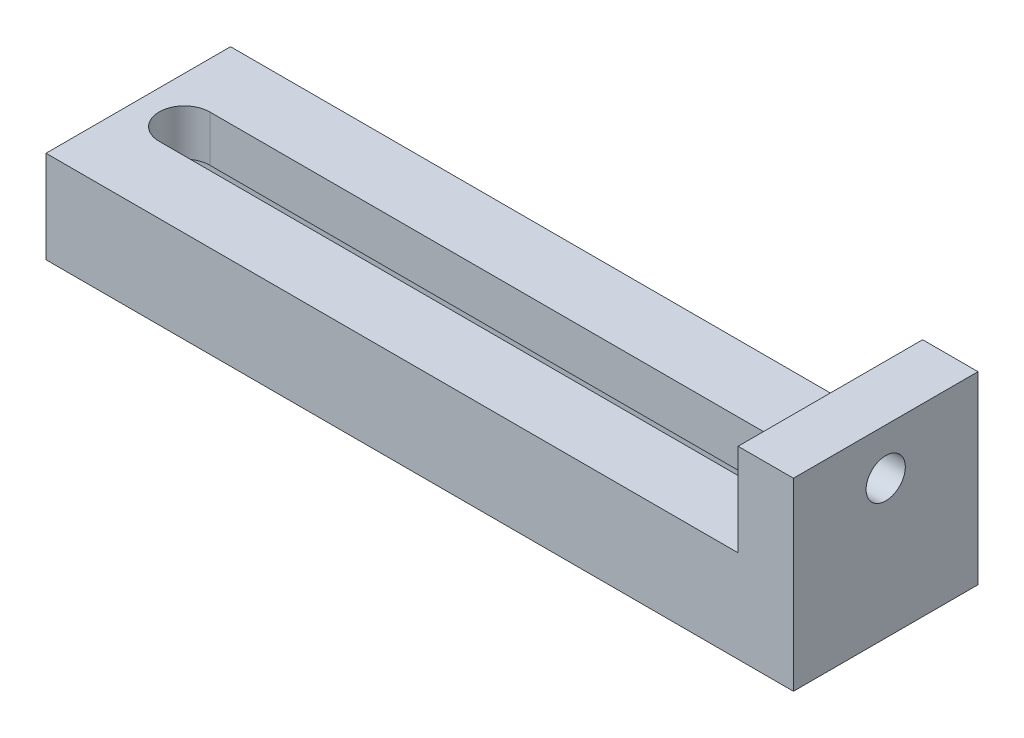
ISO-10303-21;
HEADER;
FILE_DESCRIPTION(('STEP AP214'),'2;1');
FILE_NAME('part.step','',(''),(''),'','','');
FILE_SCHEMA(('AUTOMOTIVE_DESIGN { 1 0 10303 214 1 1 1 1 }'));
ENDSEC;
DATA;
#1=APPLICATION_CONTEXT('core data for automotive mechanical design processes');
#2=APPLICATION_PROTOCOL_DEFINITION('international standard','automotive_design',2000,#1);
#3=PRODUCT_CONTEXT('',#1,'mechanical');
#4=PRODUCT('Part','Part','',(#3));
#5=PRODUCT_RELATED_PRODUCT_CATEGORY('part','',(#4));
#6=PRODUCT_DEFINITION_FORMATION('','',#4);
#7=PRODUCT_DEFINITION_CONTEXT('part definition',#1,'design');
#8=PRODUCT_DEFINITION('design','',#6,#7);
#9=PRODUCT_DEFINITION_SHAPE('','',#8);
#10=(LENGTH_UNIT() NAMED_UNIT(*) SI_UNIT(.MILLI.,.METRE.));
#11=(NAMED_UNIT(*) PLANE_ANGLE_UNIT() SI_UNIT($,.RADIAN.));
#12=(NAMED_UNIT(*) SI_UNIT($,.STERADIAN.) SOLID_ANGLE_UNIT());
#13=UNCERTAINTY_MEASURE_WITH_UNIT(LENGTH_MEASURE(1.E-05),#10,'distance_accuracy_value','');
#14=(GEOMETRIC_REPRESENTATION_CONTEXT(3) GLOBAL_UNCERTAINTY_ASSIGNED_CONTEXT((#13)) GLOBAL_UNIT_ASSIGNED_CONTEXT((#10,
#11,#12)) REPRESENTATION_CONTEXT('',''));
#15=CARTESIAN_POINT('',(0.,0.,0.));
#16=DIRECTION('',(0.,0.,1.));
#17=DIRECTION('',(1.,0.,0.));
#18=AXIS2_PLACEMENT_3D('',#15,#16,#17);
#19=CARTESIAN_POINT('',(-75.,20.,-20.));
#20=DIRECTION('',(0.,0.,1.));
#21=DIRECTION('',(1.,0.,0.));
#22=AXIS2_PLACEMENT_3D('',#19,#20,#21);
#23=PLANE('',#22);
#24=DIRECTION('',(-1.,0.,0.));
#25=VECTOR('',#24,1.);
#26=CARTESIAN_POINT('',(-75.,0.,-20.));
#27=LINE('',#26,#25);
#28=CARTESIAN_POINT('',(87.,0.,-20.));
#29=VERTEX_POINT('',#28);
#30=CARTESIAN_POINT('',(-75.,0.,-20.));
#31=VERTEX_POINT('',#30);
#32=EDGE_CURVE('E165',#29,#31,#27,.T.);
#33=ORIENTED_EDGE('',*,*,#32,.T.);
#34=DIRECTION('',(0.,-1.,0.));
#35=VECTOR('',#34,1.);
#36=CARTESIAN_POINT('',(-75.,20.,-20.));
#37=LINE('',#36,#35);
#38=CARTESIAN_POINT('',(-75.,20.,-20.));
#39=VERTEX_POINT('',#38);
#40=EDGE_CURVE('E45',#39,#31,#37,.T.);
#41=ORIENTED_EDGE('',*,*,#40,.F.);
#42=DIRECTION('',(-1.,0.,0.));
#43=VECTOR('',#42,1.);
#44=CARTESIAN_POINT('',(-75.,20.,-20.));
#45=LINE('',#44,#43);
#46=CARTESIAN_POINT('',(75.,20.,-20.));
#47=VERTEX_POINT('',#46);
#48=EDGE_CURVE('E180',#47,#39,#45,.T.);
#49=ORIENTED_EDGE('',*,*,#48,.F.);
#50=DIRECTION('',(0.,-1.,0.));
#51=VECTOR('',#50,1.);
#52=CARTESIAN_POINT('',(75.,40.,-20.));
#53=LINE('',#52,#51);
#54=CARTESIAN_POINT('',(75.,40.,-20.));
#55=VERTEX_POINT('',#54);
#56=EDGE_CURVE('E185',#55,#47,#53,.T.);
#57=ORIENTED_EDGE('',*,*,#56,.F.);
#58=DIRECTION('',(1.,0.,0.));
#59=VECTOR('',#58,1.);
#60=CARTESIAN_POINT('',(75.,40.,-20.));
#61=LINE('',#60,#59);
#62=CARTESIAN_POINT('',(87.,40.,-20.));
#63=VERTEX_POINT('',#62);
#64=EDGE_CURVE('E207',#55,#63,#61,.T.);
#65=ORIENTED_EDGE('',*,*,#64,.T.);
#66=DIRECTION('',(0.,-1.,0.));
#67=VECTOR('',#66,1.);
#68=CARTESIAN_POINT('',(87.,40.,-20.));
#69=LINE('',#68,#67);
#70=EDGE_CURVE('E187',#63,#29,#69,.T.);
#71=ORIENTED_EDGE('',*,*,#70,.T.);
#72=EDGE_LOOP('',(#33,#41,#49,#57,#65,#71));
#73=FACE_BOUND('',#72,.T.);
#74=ADVANCED_FACE('F38',(#73),#23,.F.);
#75=CARTESIAN_POINT('',(-75.,20.,-20.));
#76=DIRECTION('',(1.,0.,0.));
#77=DIRECTION('',(0.,0.,-1.));
#78=AXIS2_PLACEMENT_3D('',#75,#76,#77);
#79=PLANE('',#78);
#80=DIRECTION('',(0.,0.,1.));
#81=VECTOR('',#80,1.);
#82=CARTESIAN_POINT('',(-75.,0.,-20.));
#83=LINE('',#82,#81);
#84=CARTESIAN_POINT('',(-75.,0.,-8.));
#85=VERTEX_POINT('',#84);
#86=EDGE_CURVE('E149',#31,#85,#83,.T.);
#87=ORIENTED_EDGE('',*,*,#86,.T.);
#88=DIRECTION('',(0.,-1.,0.));
#89=VECTOR('',#88,1.);
#90=CARTESIAN_POINT('',(-75.,0.,-8.));
#91=LINE('',#90,#89);
#92=CARTESIAN_POINT('',(-75.,10.,-8.));
#93=VERTEX_POINT('',#92);
#94=EDGE_CURVE('E135',#93,#85,#91,.T.);
#95=ORIENTED_EDGE('',*,*,#94,.F.);
#96=DIRECTION('',(0.,0.,-1.));
#97=VECTOR('',#96,1.);
#98=CARTESIAN_POINT('',(-75.,10.,-8.));
#99=LINE('',#98,#97);
#100=CARTESIAN_POINT('',(-75.,10.,8.));
#101=VERTEX_POINT('',#100);
#102=EDGE_CURVE('E154',#101,#93,#99,.T.);
#103=ORIENTED_EDGE('',*,*,#102,.F.);
#104=DIRECTION('',(0.,1.,0.));
#105=VECTOR('',#104,1.);
#106=CARTESIAN_POINT('',(-75.,0.,8.));
#107=LINE('',#106,#105);
#108=CARTESIAN_POINT('',(-75.,0.,8.));
#109=VERTEX_POINT('',#108);
#110=EDGE_CURVE('E143',#109,#101,#107,.T.);
#111=ORIENTED_EDGE('',*,*,#110,.F.);
#112=CARTESIAN_POINT('',(-75.,0.,20.));
#113=VERTEX_POINT('',#112);
#114=EDGE_CURVE('E161',#109,#113,#83,.T.);
#115=ORIENTED_EDGE('',*,*,#114,.T.);
#116=DIRECTION('',(0.,-1.,0.));
#117=VECTOR('',#116,1.);
#118=CARTESIAN_POINT('',(-75.,20.,20.));
#119=LINE('',#118,#117);
#120=CARTESIAN_POINT('',(-75.,20.,20.));
#121=VERTEX_POINT('',#120);
#122=EDGE_CURVE('E169',#121,#113,#119,.T.);
#123=ORIENTED_EDGE('',*,*,#122,.F.);
#124=DIRECTION('',(0.,0.,1.));
#125=VECTOR('',#124,1.);
#126=CARTESIAN_POINT('',(-75.,20.,-20.));
#127=LINE('',#126,#125);
#128=EDGE_CURVE('E177',#39,#121,#127,.T.);
#129=ORIENTED_EDGE('',*,*,#128,.F.);
#130=ORIENTED_EDGE('',*,*,#40,.T.);
#131=EDGE_LOOP('',(#87,#95,#103,#111,#115,#123,#129,#130));
#132=FACE_BOUND('',#131,.T.);
#133=ADVANCED_FACE('F157',(#132),#79,.F.);
#134=CARTESIAN_POINT('',(-75.,20.,20.));
#135=DIRECTION('',(0.,0.,-1.));
#136=DIRECTION('',(-1.,0.,0.));
#137=AXIS2_PLACEMENT_3D('',#134,#135,#136);
#138=PLANE('',#137);
#139=DIRECTION('',(1.,0.,0.));
#140=VECTOR('',#139,1.);
#141=CARTESIAN_POINT('',(-75.,0.,20.));
#142=LINE('',#141,#140);
#143=CARTESIAN_POINT('',(87.,0.,20.));
#144=VERTEX_POINT('',#143);
#145=EDGE_CURVE('E160',#113,#144,#142,.T.);
#146=ORIENTED_EDGE('',*,*,#145,.T.);
#147=DIRECTION('',(0.,-1.,0.));
#148=VECTOR('',#147,1.);
#149=CARTESIAN_POINT('',(87.,40.,20.));
#150=LINE('',#149,#148);
#151=CARTESIAN_POINT('',(87.,40.,20.));
#152=VERTEX_POINT('',#151);
#153=EDGE_CURVE('E191',#152,#144,#150,.T.);
#154=ORIENTED_EDGE('',*,*,#153,.F.);
#155=DIRECTION('',(-1.,0.,0.));
#156=VECTOR('',#155,1.);
#157=CARTESIAN_POINT('',(75.,40.,20.));
#158=LINE('',#157,#156);
#159=CARTESIAN_POINT('',(75.,40.,20.));
#160=VERTEX_POINT('',#159);
#161=EDGE_CURVE('E188',#152,#160,#158,.T.);
#162=ORIENTED_EDGE('',*,*,#161,.T.);
#163=DIRECTION('',(0.,-1.,0.));
#164=VECTOR('',#163,1.);
#165=CARTESIAN_POINT('',(75.,40.,20.));
#166=LINE('',#165,#164);
#167=CARTESIAN_POINT('',(75.,20.,20.));
#168=VERTEX_POINT('',#167);
#169=EDGE_CURVE('E194',#160,#168,#166,.T.);
#170=ORIENTED_EDGE('',*,*,#169,.T.);
#171=DIRECTION('',(1.,0.,0.));
#172=VECTOR('',#171,1.);
#173=CARTESIAN_POINT('',(-75.,20.,20.));
#174=LINE('',#173,#172);
#175=EDGE_CURVE('E171',#121,#168,#174,.T.);
#176=ORIENTED_EDGE('',*,*,#175,.F.);
#177=ORIENTED_EDGE('',*,*,#122,.T.);
#178=EDGE_LOOP('',(#146,#154,#162,#170,#176,#177));
#179=FACE_BOUND('',#178,.T.);
#180=ADVANCED_FACE('F306',(#179),#138,.F.);
#181=CARTESIAN_POINT('',(0.,20.,0.));
#182=DIRECTION('',(0.,1.,0.));
#183=DIRECTION('',(0.,0.,1.));
#184=AXIS2_PLACEMENT_3D('',#181,#182,#183);
#185=PLANE('',#184);
#186=DIRECTION('',(1.,0.,0.));
#187=VECTOR('',#186,1.);
#188=CARTESIAN_POINT('',(0.,20.,5.50000000000045));
#189=LINE('',#188,#187);
#190=CARTESIAN_POINT('',(-65.,20.,5.50000000000046));
#191=VERTEX_POINT('',#190);
#192=CARTESIAN_POINT('',(65.,20.,5.50000000000044));
#193=VERTEX_POINT('',#192);
#194=EDGE_CURVE('E228',#191,#193,#189,.T.);
#195=ORIENTED_EDGE('',*,*,#194,.F.);
#196=CARTESIAN_POINT('',(-65.,20.,4.57966997657877E-13));
#197=DIRECTION('',(0.,1.,0.));
#198=DIRECTION('',(0.,0.,1.));
#199=AXIS2_PLACEMENT_3D('',#196,#197,#198);
#200=CIRCLE('',#199,5.49999999999999);
#201=CARTESIAN_POINT('',(-65.,20.,-5.49999999999951));
#202=VERTEX_POINT('',#201);
#203=EDGE_CURVE('E215',#202,#191,#200,.T.);
#204=ORIENTED_EDGE('',*,*,#203,.F.);
#205=DIRECTION('',(1.,0.,0.));
#206=VECTOR('',#205,1.);
#207=CARTESIAN_POINT('',(0.,20.,-5.49999999999953));
#208=LINE('',#207,#206);
#209=CARTESIAN_POINT('',(65.,20.,-5.49999999999956));
#210=VERTEX_POINT('',#209);
#211=EDGE_CURVE('E222',#202,#210,#208,.T.);
#212=ORIENTED_EDGE('',*,*,#211,.T.);
#213=CARTESIAN_POINT('',(65.,20.,4.44089209850063E-13));
#214=DIRECTION('',(0.,1.,0.));
#215=DIRECTION('',(0.,0.,1.));
#216=AXIS2_PLACEMENT_3D('',#213,#214,#215);
#217=CIRCLE('',#216,5.5);
#218=EDGE_CURVE('E225',#193,#210,#217,.T.);
#219=ORIENTED_EDGE('',*,*,#218,.F.);
#220=EDGE_LOOP('',(#195,#204,#212,#219));
#221=FACE_BOUND('',#220,.T.);
#222=DIRECTION('',(0.,0.,-1.));
#223=VECTOR('',#222,1.);
#224=CARTESIAN_POINT('',(75.,20.,-20.));
#225=LINE('',#224,#223);
#226=EDGE_CURVE('E163',#168,#47,#225,.T.);
#227=ORIENTED_EDGE('',*,*,#226,.T.);
#228=ORIENTED_EDGE('',*,*,#48,.T.);
#229=ORIENTED_EDGE('',*,*,#128,.T.);
#230=ORIENTED_EDGE('',*,*,#175,.T.);
#231=EDGE_LOOP('',(#227,#228,#229,#230));
#232=FACE_BOUND('',#231,.T.);
#233=ADVANCED_FACE('F283',(#221,#232),#185,.T.);
#234=CARTESIAN_POINT('',(0.,0.,0.));
#235=DIRECTION('',(0.,1.,0.));
#236=DIRECTION('',(0.,0.,1.));
#237=AXIS2_PLACEMENT_3D('',#234,#235,#236);
#238=PLANE('',#237);
#239=DIRECTION('',(0.,0.,-1.));
#240=VECTOR('',#239,1.);
#241=CARTESIAN_POINT('',(75.,0.,-8.));
#242=LINE('',#241,#240);
#243=CARTESIAN_POINT('',(75.,0.,8.));
#244=VERTEX_POINT('',#243);
#245=CARTESIAN_POINT('',(75.,0.,-8.));
#246=VERTEX_POINT('',#245);
#247=EDGE_CURVE('E152',#244,#246,#242,.T.);
#248=ORIENTED_EDGE('',*,*,#247,.T.);
#249=DIRECTION('',(-1.,0.,0.));
#250=VECTOR('',#249,1.);
#251=CARTESIAN_POINT('',(93.8679622641132,0.,-8.));
#252=LINE('',#251,#250);
#253=EDGE_CURVE('E52',#246,#85,#252,.T.);
#254=ORIENTED_EDGE('',*,*,#253,.T.);
#255=ORIENTED_EDGE('',*,*,#86,.F.);
#256=ORIENTED_EDGE('',*,*,#32,.F.);
#257=DIRECTION('',(0.,0.,1.));
#258=VECTOR('',#257,1.);
#259=CARTESIAN_POINT('',(87.,0.,20.));
#260=LINE('',#259,#258);
#261=EDGE_CURVE('E197',#29,#144,#260,.T.);
#262=ORIENTED_EDGE('',*,*,#261,.T.);
#263=ORIENTED_EDGE('',*,*,#145,.F.);
#264=ORIENTED_EDGE('',*,*,#114,.F.);
#265=DIRECTION('',(-1.,0.,0.));
#266=VECTOR('',#265,1.);
#267=CARTESIAN_POINT('',(93.8679622641132,0.,8.));
#268=LINE('',#267,#266);
#269=EDGE_CURVE('E153',#244,#109,#268,.T.);
#270=ORIENTED_EDGE('',*,*,#269,.F.);
#271=EDGE_LOOP('',(#248,#254,#255,#256,#262,#263,#264,#270));
#272=FACE_BOUND('',#271,.T.);
#273=ADVANCED_FACE('F148',(#272),#238,.F.);
#274=CARTESIAN_POINT('',(75.,40.,20.));
#275=DIRECTION('',(-1.,0.,0.));
#276=DIRECTION('',(0.,0.,1.));
#277=AXIS2_PLACEMENT_3D('',#274,#275,#276);
#278=PLANE('',#277);
#279=CARTESIAN_POINT('',(75.,30.,0.));
#280=DIRECTION('',(-1.,0.,0.));
#281=DIRECTION('',(0.,0.,1.));
#282=AXIS2_PLACEMENT_3D('',#279,#280,#281);
#283=CIRCLE('',#282,4.24999999999999);
#284=CARTESIAN_POINT('',(75.,30.,4.24999999999999));
#285=VERTEX_POINT('',#284);
#286=EDGE_CURVE('E231',#285,#285,#283,.T.);
#287=ORIENTED_EDGE('',*,*,#286,.F.);
#288=EDGE_LOOP('',(#287));
#289=FACE_BOUND('',#288,.T.);
#290=ORIENTED_EDGE('',*,*,#226,.F.);
#291=ORIENTED_EDGE('',*,*,#169,.F.);
#292=DIRECTION('',(0.,0.,-1.));
#293=VECTOR('',#292,1.);
#294=CARTESIAN_POINT('',(75.,40.,20.));
#295=LINE('',#294,#293);
#296=EDGE_CURVE('E200',#160,#55,#295,.T.);
#297=ORIENTED_EDGE('',*,*,#296,.T.);
#298=ORIENTED_EDGE('',*,*,#56,.T.);
#299=EDGE_LOOP('',(#290,#291,#297,#298));
#300=FACE_BOUND('',#299,.T.);
#301=ADVANCED_FACE('F315',(#289,#300),#278,.T.);
#302=CARTESIAN_POINT('',(87.,40.,20.));
#303=DIRECTION('',(1.,0.,0.));
#304=DIRECTION('',(0.,0.,-1.));
#305=AXIS2_PLACEMENT_3D('',#302,#303,#304);
#306=PLANE('',#305);
#307=CARTESIAN_POINT('',(87.,30.,0.));
#308=DIRECTION('',(1.,0.,0.));
#309=DIRECTION('',(0.,0.,-1.));
#310=AXIS2_PLACEMENT_3D('',#307,#308,#309);
#311=CIRCLE('',#310,4.24999999999999);
#312=CARTESIAN_POINT('',(87.,30.,-4.24999999999999));
#313=VERTEX_POINT('',#312);
#314=EDGE_CURVE('E234',#313,#313,#311,.T.);
#315=ORIENTED_EDGE('',*,*,#314,.F.);
#316=EDGE_LOOP('',(#315));
#317=FACE_BOUND('',#316,.T.);
#318=ORIENTED_EDGE('',*,*,#261,.F.);
#319=ORIENTED_EDGE('',*,*,#70,.F.);
#320=DIRECTION('',(0.,0.,1.));
#321=VECTOR('',#320,1.);
#322=CARTESIAN_POINT('',(87.,40.,20.));
#323=LINE('',#322,#321);
#324=EDGE_CURVE('E204',#63,#152,#323,.T.);
#325=ORIENTED_EDGE('',*,*,#324,.T.);
#326=ORIENTED_EDGE('',*,*,#153,.T.);
#327=EDGE_LOOP('',(#318,#319,#325,#326));
#328=FACE_BOUND('',#327,.T.);
#329=ADVANCED_FACE('F297',(#317,#328),#306,.T.);
#330=CARTESIAN_POINT('',(0.,40.,0.));
#331=DIRECTION('',(0.,-1.,0.));
#332=DIRECTION('',(0.,0.,-1.));
#333=AXIS2_PLACEMENT_3D('',#330,#331,#332);
#334=PLANE('',#333);
#335=ORIENTED_EDGE('',*,*,#296,.F.);
#336=ORIENTED_EDGE('',*,*,#161,.F.);
#337=ORIENTED_EDGE('',*,*,#324,.F.);
#338=ORIENTED_EDGE('',*,*,#64,.F.);
#339=EDGE_LOOP('',(#335,#336,#337,#338));
#340=FACE_BOUND('',#339,.T.);
#341=ADVANCED_FACE('F290',(#340),#334,.F.);
#342=CARTESIAN_POINT('',(0.,-20.,5.50000000000045));
#343=DIRECTION('',(0.,0.,1.));
#344=DIRECTION('',(1.,0.,0.));
#345=AXIS2_PLACEMENT_3D('',#342,#343,#344);
#346=PLANE('',#345);
#347=DIRECTION('',(0.,1.,0.));
#348=VECTOR('',#347,1.);
#349=CARTESIAN_POINT('',(65.,-20.,5.50000000000044));
#350=LINE('',#349,#348);
#351=CARTESIAN_POINT('',(65.,10.,5.50000000000044));
#352=VERTEX_POINT('',#351);
#353=EDGE_CURVE('E212',#352,#193,#350,.T.);
#354=ORIENTED_EDGE('',*,*,#353,.F.);
#355=DIRECTION('',(-1.,0.,0.));
#356=VECTOR('',#355,1.);
#357=CARTESIAN_POINT('',(0.,10.,5.50000000000045));
#358=LINE('',#357,#356);
#359=CARTESIAN_POINT('',(-65.,10.,5.50000000000044));
#360=VERTEX_POINT('',#359);
#361=EDGE_CURVE('E60',#352,#360,#358,.T.);
#362=ORIENTED_EDGE('',*,*,#361,.T.);
#363=DIRECTION('',(0.,1.,0.));
#364=VECTOR('',#363,1.);
#365=CARTESIAN_POINT('',(-65.,-20.,5.50000000000046));
#366=LINE('',#365,#364);
#367=EDGE_CURVE('E201',#360,#191,#366,.T.);
#368=ORIENTED_EDGE('',*,*,#367,.T.);
#369=ORIENTED_EDGE('',*,*,#194,.T.);
#370=EDGE_LOOP('',(#354,#362,#368,#369));
#371=FACE_BOUND('',#370,.T.);
#372=ADVANCED_FACE('F288',(#371),#346,.F.);
#373=CARTESIAN_POINT('',(-65.,-20.,4.57966997657877E-13));
#374=DIRECTION('',(0.,1.,0.));
#375=DIRECTION('',(0.,0.,1.));
#376=AXIS2_PLACEMENT_3D('',#373,#374,#375);
#377=CYLINDRICAL_SURFACE('',#376,5.49999999999999);
#378=ORIENTED_EDGE('',*,*,#367,.F.);
#379=CARTESIAN_POINT('',(-65.,10.,4.57966997657877E-13));
#380=DIRECTION('',(0.,1.,0.));
#381=DIRECTION('',(0.,0.,1.));
#382=AXIS2_PLACEMENT_3D('',#379,#380,#381);
#383=CIRCLE('',#382,5.49999999999999);
#384=CARTESIAN_POINT('',(-65.,10.,-5.49999999999951));
#385=VERTEX_POINT('',#384);
#386=EDGE_CURVE('E238',#360,#385,#383,.F.);
#387=ORIENTED_EDGE('',*,*,#386,.T.);
#388=DIRECTION('',(0.,1.,0.));
#389=VECTOR('',#388,1.);
#390=CARTESIAN_POINT('',(-65.,-20.,-5.49999999999951));
#391=LINE('',#390,#389);
#392=EDGE_CURVE('E217',#385,#202,#391,.T.);
#393=ORIENTED_EDGE('',*,*,#392,.T.);
#394=ORIENTED_EDGE('',*,*,#203,.T.);
#395=EDGE_LOOP('',(#378,#387,#393,#394));
#396=FACE_BOUND('',#395,.T.);
#397=ADVANCED_FACE('F286',(#396),#377,.F.);
#398=CARTESIAN_POINT('',(0.,-20.,-5.49999999999953));
#399=DIRECTION('',(0.,0.,1.));
#400=DIRECTION('',(1.,0.,0.));
#401=AXIS2_PLACEMENT_3D('',#398,#399,#400);
#402=PLANE('',#401);
#403=DIRECTION('',(-1.,0.,0.));
#404=VECTOR('',#403,1.);
#405=CARTESIAN_POINT('',(0.,10.,-5.49999999999953));
#406=LINE('',#405,#404);
#407=CARTESIAN_POINT('',(65.,10.,-5.49999999999956));
#408=VERTEX_POINT('',#407);
#409=EDGE_CURVE('E241',#408,#385,#406,.T.);
#410=ORIENTED_EDGE('',*,*,#409,.F.);
#411=DIRECTION('',(0.,1.,0.));
#412=VECTOR('',#411,1.);
#413=CARTESIAN_POINT('',(65.,-20.,-5.49999999999956));
#414=LINE('',#413,#412);
#415=EDGE_CURVE('E214',#408,#210,#414,.T.);
#416=ORIENTED_EDGE('',*,*,#415,.T.);
#417=ORIENTED_EDGE('',*,*,#211,.F.);
#418=ORIENTED_EDGE('',*,*,#392,.F.);
#419=EDGE_LOOP('',(#410,#416,#417,#418));
#420=FACE_BOUND('',#419,.T.);
#421=ADVANCED_FACE('F276',(#420),#402,.T.);
#422=CARTESIAN_POINT('',(65.,-20.,4.44089209850063E-13));
#423=DIRECTION('',(0.,1.,0.));
#424=DIRECTION('',(0.,0.,1.));
#425=AXIS2_PLACEMENT_3D('',#422,#423,#424);
#426=CYLINDRICAL_SURFACE('',#425,5.5);
#427=ORIENTED_EDGE('',*,*,#415,.F.);
#428=CARTESIAN_POINT('',(65.,10.,4.44089209850063E-13));
#429=DIRECTION('',(0.,1.,0.));
#430=DIRECTION('',(0.,0.,1.));
#431=AXIS2_PLACEMENT_3D('',#428,#429,#430);
#432=CIRCLE('',#431,5.5);
#433=EDGE_CURVE('E11',#408,#352,#432,.F.);
#434=ORIENTED_EDGE('',*,*,#433,.T.);
#435=ORIENTED_EDGE('',*,*,#353,.T.);
#436=ORIENTED_EDGE('',*,*,#218,.T.);
#437=EDGE_LOOP('',(#427,#434,#435,#436));
#438=FACE_BOUND('',#437,.T.);
#439=ADVANCED_FACE('F278',(#438),#426,.F.);
#440=CARTESIAN_POINT('',(87.,30.,0.));
#441=DIRECTION('',(1.,0.,0.));
#442=DIRECTION('',(0.,0.,-1.));
#443=AXIS2_PLACEMENT_3D('',#440,#441,#442);
#444=CYLINDRICAL_SURFACE('',#443,4.24999999999999);
#445=ORIENTED_EDGE('',*,*,#286,.T.);
#446=EDGE_LOOP('',(#445));
#447=FACE_BOUND('',#446,.T.);
#448=ORIENTED_EDGE('',*,*,#314,.T.);
#449=EDGE_LOOP('',(#448));
#450=FACE_BOUND('',#449,.T.);
#451=ADVANCED_FACE('F268',(#447,#450),#444,.F.);
#452=CARTESIAN_POINT('',(93.8679622641132,10.,-8.));
#453=DIRECTION('',(0.,1.,0.));
#454=DIRECTION('',(0.,0.,1.));
#455=AXIS2_PLACEMENT_3D('',#452,#453,#454);
#456=PLANE('',#455);
#457=DIRECTION('',(0.,0.,1.));
#458=VECTOR('',#457,1.);
#459=CARTESIAN_POINT('',(75.,10.,-8.));
#460=LINE('',#459,#458);
#461=CARTESIAN_POINT('',(75.,10.,-8.));
#462=VERTEX_POINT('',#461);
#463=CARTESIAN_POINT('',(75.,10.,8.));
#464=VERTEX_POINT('',#463);
#465=EDGE_CURVE('E254',#462,#464,#460,.T.);
#466=ORIENTED_EDGE('',*,*,#465,.T.);
#467=DIRECTION('',(-1.,0.,0.));
#468=VECTOR('',#467,1.);
#469=CARTESIAN_POINT('',(93.8679622641132,10.,8.));
#470=LINE('',#469,#468);
#471=EDGE_CURVE('E246',#464,#101,#470,.T.);
#472=ORIENTED_EDGE('',*,*,#471,.T.);
#473=ORIENTED_EDGE('',*,*,#102,.T.);
#474=DIRECTION('',(-1.,0.,0.));
#475=VECTOR('',#474,1.);
#476=CARTESIAN_POINT('',(93.8679622641132,10.,-8.));
#477=LINE('',#476,#475);
#478=EDGE_CURVE('E138',#462,#93,#477,.T.);
#479=ORIENTED_EDGE('',*,*,#478,.F.);
#480=EDGE_LOOP('',(#466,#472,#473,#479));
#481=FACE_BOUND('',#480,.T.);
#482=ORIENTED_EDGE('',*,*,#433,.F.);
#483=ORIENTED_EDGE('',*,*,#409,.T.);
#484=ORIENTED_EDGE('',*,*,#386,.F.);
#485=ORIENTED_EDGE('',*,*,#361,.F.);
#486=EDGE_LOOP('',(#482,#483,#484,#485));
#487=FACE_BOUND('',#486,.T.);
#488=ADVANCED_FACE('F266',(#481,#487),#456,.F.);
#489=CARTESIAN_POINT('',(93.8679622641132,0.,-8.));
#490=DIRECTION('',(0.,0.,-1.));
#491=DIRECTION('',(0.,1.,0.));
#492=AXIS2_PLACEMENT_3D('',#489,#490,#491);
#493=PLANE('',#492);
#494=DIRECTION('',(0.,1.,0.));
#495=VECTOR('',#494,1.);
#496=CARTESIAN_POINT('',(75.,0.,-8.));
#497=LINE('',#496,#495);
#498=EDGE_CURVE('E243',#246,#462,#497,.T.);
#499=ORIENTED_EDGE('',*,*,#498,.T.);
#500=ORIENTED_EDGE('',*,*,#478,.T.);
#501=ORIENTED_EDGE('',*,*,#94,.T.);
#502=ORIENTED_EDGE('',*,*,#253,.F.);
#503=EDGE_LOOP('',(#499,#500,#501,#502));
#504=FACE_BOUND('',#503,.T.);
#505=ADVANCED_FACE('F136',(#504),#493,.F.);
#506=CARTESIAN_POINT('',(93.8679622641132,0.,8.));
#507=DIRECTION('',(0.,0.,1.));
#508=DIRECTION('',(0.,-1.,0.));
#509=AXIS2_PLACEMENT_3D('',#506,#507,#508);
#510=PLANE('',#509);
#511=DIRECTION('',(0.,-1.,0.));
#512=VECTOR('',#511,1.);
#513=CARTESIAN_POINT('',(75.,0.,8.));
#514=LINE('',#513,#512);
#515=EDGE_CURVE('E249',#464,#244,#514,.T.);
#516=ORIENTED_EDGE('',*,*,#515,.T.);
#517=ORIENTED_EDGE('',*,*,#269,.T.);
#518=ORIENTED_EDGE('',*,*,#110,.T.);
#519=ORIENTED_EDGE('',*,*,#471,.F.);
#520=EDGE_LOOP('',(#516,#517,#518,#519));
#521=FACE_BOUND('',#520,.T.);
#522=ADVANCED_FACE('F259',(#521),#510,.F.);
#523=CARTESIAN_POINT('',(75.,40.,20.));
#524=DIRECTION('',(-1.,0.,0.));
#525=DIRECTION('',(0.,0.,1.));
#526=AXIS2_PLACEMENT_3D('',#523,#524,#525);
#527=PLANE('',#526);
#528=ORIENTED_EDGE('',*,*,#498,.F.);
#529=ORIENTED_EDGE('',*,*,#247,.F.);
#530=ORIENTED_EDGE('',*,*,#515,.F.);
#531=ORIENTED_EDGE('',*,*,#465,.F.);
#532=EDGE_LOOP('',(#528,#529,#530,#531));
#533=FACE_BOUND('',#532,.T.);
#534=ADVANCED_FACE('F263',(#533),#527,.T.);
#535=CLOSED_SHELL('',(#74,#133,#180,#233,#273,#301,#329,#341,#372,#397,#421,#439,#451,#488,#505,
#522,#534));
#536=MANIFOLD_SOLID_BREP('B2',#535);
#537=ADVANCED_BREP_SHAPE_REPRESENTATION('',(#18,#536),#14);
#538=SHAPE_DEFINITION_REPRESENTATION(#9,#537);
ENDSEC;
END-ISO-10303-21;
